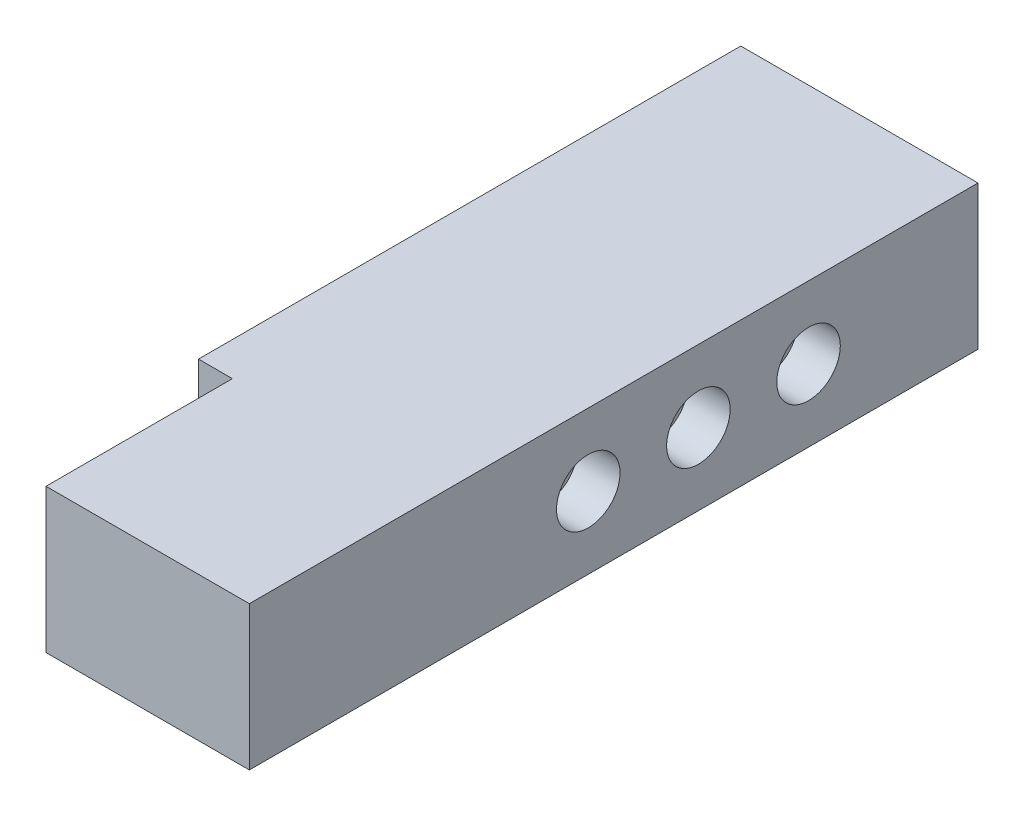
ISO-10303-21;
HEADER;
FILE_DESCRIPTION(('STEP AP214'),'2;1');
FILE_NAME('part.step','',(''),(''),'','','');
FILE_SCHEMA(('AUTOMOTIVE_DESIGN { 1 0 10303 214 1 1 1 1 }'));
ENDSEC;
DATA;
#1=APPLICATION_CONTEXT('core data for automotive mechanical design processes');
#2=APPLICATION_PROTOCOL_DEFINITION('international standard','automotive_design',2000,#1);
#3=PRODUCT_CONTEXT('',#1,'mechanical');
#4=PRODUCT('Part','Part','',(#3));
#5=PRODUCT_RELATED_PRODUCT_CATEGORY('part','',(#4));
#6=PRODUCT_DEFINITION_FORMATION('','',#4);
#7=PRODUCT_DEFINITION_CONTEXT('part definition',#1,'design');
#8=PRODUCT_DEFINITION('design','',#6,#7);
#9=PRODUCT_DEFINITION_SHAPE('','',#8);
#10=(LENGTH_UNIT() NAMED_UNIT(*) SI_UNIT(.MILLI.,.METRE.));
#11=(NAMED_UNIT(*) PLANE_ANGLE_UNIT() SI_UNIT($,.RADIAN.));
#12=(NAMED_UNIT(*) SI_UNIT($,.STERADIAN.) SOLID_ANGLE_UNIT());
#13=UNCERTAINTY_MEASURE_WITH_UNIT(LENGTH_MEASURE(1.E-05),#10,'distance_accuracy_value','');
#14=(GEOMETRIC_REPRESENTATION_CONTEXT(3) GLOBAL_UNCERTAINTY_ASSIGNED_CONTEXT((#13)) GLOBAL_UNIT_ASSIGNED_CONTEXT((#10,
#11,#12)) REPRESENTATION_CONTEXT('',''));
#15=CARTESIAN_POINT('',(0.,0.,0.));
#16=DIRECTION('',(0.,0.,1.));
#17=DIRECTION('',(1.,0.,0.));
#18=AXIS2_PLACEMENT_3D('',#15,#16,#17);
#19=CARTESIAN_POINT('',(0.,0.,81.28));
#20=DIRECTION('',(0.,0.,-1.));
#21=DIRECTION('',(-1.,0.,0.));
#22=AXIS2_PLACEMENT_3D('',#19,#20,#21);
#23=PLANE('',#22);
#24=DIRECTION('',(0.,-1.,0.));
#25=VECTOR('',#24,1.);
#26=CARTESIAN_POINT('',(5.07999999999999,21.59,81.28));
#27=LINE('',#26,#25);
#28=CARTESIAN_POINT('',(5.07999999999999,21.59,81.28));
#29=VERTEX_POINT('',#28);
#30=CARTESIAN_POINT('',(5.08,0.,81.28));
#31=VERTEX_POINT('',#30);
#32=EDGE_CURVE('E53',#29,#31,#27,.T.);
#33=ORIENTED_EDGE('',*,*,#32,.F.);
#34=DIRECTION('',(-1.,0.,0.));
#35=VECTOR('',#34,1.);
#36=CARTESIAN_POINT('',(0.,21.59,81.28));
#37=LINE('',#36,#35);
#38=CARTESIAN_POINT('',(0.,21.59,81.28));
#39=VERTEX_POINT('',#38);
#40=EDGE_CURVE('E58',#29,#39,#37,.T.);
#41=ORIENTED_EDGE('',*,*,#40,.T.);
#42=DIRECTION('',(0.,-1.,0.));
#43=VECTOR('',#42,1.);
#44=CARTESIAN_POINT('',(0.,0.,81.28));
#45=LINE('',#44,#43);
#46=CARTESIAN_POINT('',(0.,0.,81.28));
#47=VERTEX_POINT('',#46);
#48=EDGE_CURVE('E89',#39,#47,#45,.T.);
#49=ORIENTED_EDGE('',*,*,#48,.T.);
#50=DIRECTION('',(1.,0.,0.));
#51=VECTOR('',#50,1.);
#52=CARTESIAN_POINT('',(0.,0.,81.28));
#53=LINE('',#52,#51);
#54=EDGE_CURVE('E140',#47,#31,#53,.T.);
#55=ORIENTED_EDGE('',*,*,#54,.T.);
#56=EDGE_LOOP('',(#33,#41,#49,#55));
#57=FACE_BOUND('',#56,.T.);
#58=ADVANCED_FACE('F38',(#57),#23,.F.);
#59=CARTESIAN_POINT('',(0.,0.,81.28));
#60=DIRECTION('',(1.,0.,0.));
#61=DIRECTION('',(0.,0.,-1.));
#62=AXIS2_PLACEMENT_3D('',#59,#60,#61);
#63=PLANE('',#62);
#64=CARTESIAN_POINT('',(0.,10.795,33.655));
#65=DIRECTION('',(-1.,0.,0.));
#66=DIRECTION('',(0.,0.,1.));
#67=AXIS2_PLACEMENT_3D('',#64,#65,#66);
#68=CIRCLE('',#67,4.7625);
#69=CARTESIAN_POINT('',(0.,10.795,38.4175));
#70=VERTEX_POINT('',#69);
#71=EDGE_CURVE('E175',#70,#70,#68,.T.);
#72=ORIENTED_EDGE('',*,*,#71,.F.);
#73=EDGE_LOOP('',(#72));
#74=FACE_BOUND('',#73,.T.);
#75=CARTESIAN_POINT('',(0.,10.795,50.165));
#76=DIRECTION('',(-1.,0.,0.));
#77=DIRECTION('',(0.,0.,1.));
#78=AXIS2_PLACEMENT_3D('',#75,#76,#77);
#79=CIRCLE('',#78,4.7625);
#80=CARTESIAN_POINT('',(0.,10.795,54.9275));
#81=VERTEX_POINT('',#80);
#82=EDGE_CURVE('E169',#81,#81,#79,.T.);
#83=ORIENTED_EDGE('',*,*,#82,.F.);
#84=EDGE_LOOP('',(#83));
#85=FACE_BOUND('',#84,.T.);
#86=DIRECTION('',(0.,-1.,0.));
#87=VECTOR('',#86,1.);
#88=CARTESIAN_POINT('',(0.,0.,0.));
#89=LINE('',#88,#87);
#90=CARTESIAN_POINT('',(0.,21.59,0.));
#91=VERTEX_POINT('',#90);
#92=CARTESIAN_POINT('',(0.,0.,0.));
#93=VERTEX_POINT('',#92);
#94=EDGE_CURVE('E95',#91,#93,#89,.T.);
#95=ORIENTED_EDGE('',*,*,#94,.T.);
#96=DIRECTION('',(0.,0.,-1.));
#97=VECTOR('',#96,1.);
#98=CARTESIAN_POINT('',(0.,0.,81.28));
#99=LINE('',#98,#97);
#100=EDGE_CURVE('E11',#47,#93,#99,.T.);
#101=ORIENTED_EDGE('',*,*,#100,.F.);
#102=ORIENTED_EDGE('',*,*,#48,.F.);
#103=DIRECTION('',(0.,0.,-1.));
#104=VECTOR('',#103,1.);
#105=CARTESIAN_POINT('',(0.,21.59,81.28));
#106=LINE('',#105,#104);
#107=EDGE_CURVE('E81',#39,#91,#106,.T.);
#108=ORIENTED_EDGE('',*,*,#107,.T.);
#109=EDGE_LOOP('',(#95,#101,#102,#108));
#110=FACE_BOUND('',#109,.T.);
#111=ADVANCED_FACE('F40',(#74,#85,#110),#63,.F.);
#112=CARTESIAN_POINT('',(0.,0.,81.28));
#113=DIRECTION('',(0.,1.,0.));
#114=DIRECTION('',(0.,0.,1.));
#115=AXIS2_PLACEMENT_3D('',#112,#113,#114);
#116=PLANE('',#115);
#117=DIRECTION('',(1.,0.,0.));
#118=VECTOR('',#117,1.);
#119=CARTESIAN_POINT('',(0.,0.,0.));
#120=LINE('',#119,#118);
#121=CARTESIAN_POINT('',(35.56,0.,0.));
#122=VERTEX_POINT('',#121);
#123=EDGE_CURVE('E98',#93,#122,#120,.T.);
#124=ORIENTED_EDGE('',*,*,#123,.T.);
#125=DIRECTION('',(0.,0.,-1.));
#126=VECTOR('',#125,1.);
#127=CARTESIAN_POINT('',(35.56,0.,81.28));
#128=LINE('',#127,#126);
#129=CARTESIAN_POINT('',(35.56,0.,109.22));
#130=VERTEX_POINT('',#129);
#131=EDGE_CURVE('E46',#130,#122,#128,.T.);
#132=ORIENTED_EDGE('',*,*,#131,.F.);
#133=DIRECTION('',(1.,0.,0.));
#134=VECTOR('',#133,1.);
#135=CARTESIAN_POINT('',(35.56,0.,109.22));
#136=LINE('',#135,#134);
#137=CARTESIAN_POINT('',(5.08,0.,109.22));
#138=VERTEX_POINT('',#137);
#139=EDGE_CURVE('E122',#138,#130,#136,.T.);
#140=ORIENTED_EDGE('',*,*,#139,.F.);
#141=DIRECTION('',(0.,0.,-1.));
#142=VECTOR('',#141,1.);
#143=CARTESIAN_POINT('',(5.08,0.,109.22));
#144=LINE('',#143,#142);
#145=EDGE_CURVE('E103',#138,#31,#144,.T.);
#146=ORIENTED_EDGE('',*,*,#145,.T.);
#147=ORIENTED_EDGE('',*,*,#54,.F.);
#148=ORIENTED_EDGE('',*,*,#100,.T.);
#149=EDGE_LOOP('',(#124,#132,#140,#146,#147,#148));
#150=FACE_BOUND('',#149,.T.);
#151=ADVANCED_FACE('F119',(#150),#116,.F.);
#152=CARTESIAN_POINT('',(35.56,0.,81.28));
#153=DIRECTION('',(-1.,0.,0.));
#154=DIRECTION('',(0.,0.,1.));
#155=AXIS2_PLACEMENT_3D('',#152,#153,#154);
#156=PLANE('',#155);
#157=CARTESIAN_POINT('',(35.56,10.795,25.4));
#158=DIRECTION('',(1.,0.,0.));
#159=DIRECTION('',(0.,0.,-1.));
#160=AXIS2_PLACEMENT_3D('',#157,#158,#159);
#161=CIRCLE('',#160,4.7625);
#162=CARTESIAN_POINT('',(35.56,10.795,20.6375));
#163=VERTEX_POINT('',#162);
#164=EDGE_CURVE('E164',#163,#163,#161,.T.);
#165=ORIENTED_EDGE('',*,*,#164,.F.);
#166=EDGE_LOOP('',(#165));
#167=FACE_BOUND('',#166,.T.);
#168=CARTESIAN_POINT('',(35.56,10.795,41.91));
#169=DIRECTION('',(1.,0.,0.));
#170=DIRECTION('',(0.,0.,-1.));
#171=AXIS2_PLACEMENT_3D('',#168,#169,#170);
#172=CIRCLE('',#171,4.7625);
#173=CARTESIAN_POINT('',(35.56,10.795,37.1475));
#174=VERTEX_POINT('',#173);
#175=EDGE_CURVE('E158',#174,#174,#172,.T.);
#176=ORIENTED_EDGE('',*,*,#175,.F.);
#177=EDGE_LOOP('',(#176));
#178=FACE_BOUND('',#177,.T.);
#179=CARTESIAN_POINT('',(35.56,10.795,58.42));
#180=DIRECTION('',(1.,0.,0.));
#181=DIRECTION('',(0.,0.,-1.));
#182=AXIS2_PLACEMENT_3D('',#179,#180,#181);
#183=CIRCLE('',#182,4.7625);
#184=CARTESIAN_POINT('',(35.56,10.795,53.6575));
#185=VERTEX_POINT('',#184);
#186=EDGE_CURVE('E151',#185,#185,#183,.T.);
#187=ORIENTED_EDGE('',*,*,#186,.F.);
#188=EDGE_LOOP('',(#187));
#189=FACE_BOUND('',#188,.T.);
#190=DIRECTION('',(0.,1.,0.));
#191=VECTOR('',#190,1.);
#192=CARTESIAN_POINT('',(35.56,0.,0.));
#193=LINE('',#192,#191);
#194=CARTESIAN_POINT('',(35.56,21.59,0.));
#195=VERTEX_POINT('',#194);
#196=EDGE_CURVE('E90',#122,#195,#193,.T.);
#197=ORIENTED_EDGE('',*,*,#196,.T.);
#198=DIRECTION('',(0.,0.,-1.));
#199=VECTOR('',#198,1.);
#200=CARTESIAN_POINT('',(35.56,21.59,81.28));
#201=LINE('',#200,#199);
#202=CARTESIAN_POINT('',(35.56,21.59,109.22));
#203=VERTEX_POINT('',#202);
#204=EDGE_CURVE('E85',#203,#195,#201,.T.);
#205=ORIENTED_EDGE('',*,*,#204,.F.);
#206=DIRECTION('',(0.,1.,0.));
#207=VECTOR('',#206,1.);
#208=CARTESIAN_POINT('',(35.56,21.59,109.22));
#209=LINE('',#208,#207);
#210=EDGE_CURVE('E115',#130,#203,#209,.T.);
#211=ORIENTED_EDGE('',*,*,#210,.F.);
#212=ORIENTED_EDGE('',*,*,#131,.T.);
#213=EDGE_LOOP('',(#197,#205,#211,#212));
#214=FACE_BOUND('',#213,.T.);
#215=ADVANCED_FACE('F113',(#167,#178,#189,#214),#156,.F.);
#216=CARTESIAN_POINT('',(0.,21.59,81.28));
#217=DIRECTION('',(0.,-1.,0.));
#218=DIRECTION('',(0.,0.,-1.));
#219=AXIS2_PLACEMENT_3D('',#216,#217,#218);
#220=PLANE('',#219);
#221=DIRECTION('',(-1.,0.,0.));
#222=VECTOR('',#221,1.);
#223=CARTESIAN_POINT('',(0.,21.59,0.));
#224=LINE('',#223,#222);
#225=EDGE_CURVE('E78',#195,#91,#224,.T.);
#226=ORIENTED_EDGE('',*,*,#225,.T.);
#227=ORIENTED_EDGE('',*,*,#107,.F.);
#228=ORIENTED_EDGE('',*,*,#40,.F.);
#229=DIRECTION('',(0.,0.,-1.));
#230=VECTOR('',#229,1.);
#231=CARTESIAN_POINT('',(5.07999999999999,21.59,109.22));
#232=LINE('',#231,#230);
#233=CARTESIAN_POINT('',(5.07999999999999,21.59,109.22));
#234=VERTEX_POINT('',#233);
#235=EDGE_CURVE('E99',#234,#29,#232,.T.);
#236=ORIENTED_EDGE('',*,*,#235,.F.);
#237=DIRECTION('',(-1.,0.,0.));
#238=VECTOR('',#237,1.);
#239=CARTESIAN_POINT('',(35.56,21.59,109.22));
#240=LINE('',#239,#238);
#241=EDGE_CURVE('E134',#203,#234,#240,.T.);
#242=ORIENTED_EDGE('',*,*,#241,.F.);
#243=ORIENTED_EDGE('',*,*,#204,.T.);
#244=EDGE_LOOP('',(#226,#227,#228,#236,#242,#243));
#245=FACE_BOUND('',#244,.T.);
#246=ADVANCED_FACE('F80',(#245),#220,.F.);
#247=CARTESIAN_POINT('',(0.,0.,0.));
#248=DIRECTION('',(0.,0.,-1.));
#249=DIRECTION('',(-1.,0.,0.));
#250=AXIS2_PLACEMENT_3D('',#247,#248,#249);
#251=PLANE('',#250);
#252=ORIENTED_EDGE('',*,*,#94,.F.);
#253=ORIENTED_EDGE('',*,*,#225,.F.);
#254=ORIENTED_EDGE('',*,*,#196,.F.);
#255=ORIENTED_EDGE('',*,*,#123,.F.);
#256=EDGE_LOOP('',(#252,#253,#254,#255));
#257=FACE_BOUND('',#256,.T.);
#258=ADVANCED_FACE('F97',(#257),#251,.T.);
#259=CARTESIAN_POINT('',(5.07999999999999,21.59,109.22));
#260=DIRECTION('',(1.,0.,0.));
#261=DIRECTION('',(0.,1.,0.));
#262=AXIS2_PLACEMENT_3D('',#259,#260,#261);
#263=PLANE('',#262);
#264=ORIENTED_EDGE('',*,*,#32,.T.);
#265=ORIENTED_EDGE('',*,*,#145,.F.);
#266=DIRECTION('',(0.,-1.,0.));
#267=VECTOR('',#266,1.);
#268=CARTESIAN_POINT('',(5.07999999999999,21.59,109.22));
#269=LINE('',#268,#267);
#270=EDGE_CURVE('E130',#234,#138,#269,.T.);
#271=ORIENTED_EDGE('',*,*,#270,.F.);
#272=ORIENTED_EDGE('',*,*,#235,.T.);
#273=EDGE_LOOP('',(#264,#265,#271,#272));
#274=FACE_BOUND('',#273,.T.);
#275=ADVANCED_FACE('F143',(#274),#263,.F.);
#276=CARTESIAN_POINT('',(0.,0.,109.22));
#277=DIRECTION('',(0.,0.,-1.));
#278=DIRECTION('',(-1.,0.,0.));
#279=AXIS2_PLACEMENT_3D('',#276,#277,#278);
#280=PLANE('',#279);
#281=ORIENTED_EDGE('',*,*,#210,.T.);
#282=ORIENTED_EDGE('',*,*,#241,.T.);
#283=ORIENTED_EDGE('',*,*,#270,.T.);
#284=ORIENTED_EDGE('',*,*,#139,.T.);
#285=EDGE_LOOP('',(#281,#282,#283,#284));
#286=FACE_BOUND('',#285,.T.);
#287=ADVANCED_FACE('F126',(#286),#280,.F.);
#288=CARTESIAN_POINT('',(29.21,10.795,58.42));
#289=DIRECTION('',(1.,0.,0.));
#290=DIRECTION('',(0.,0.,-1.));
#291=AXIS2_PLACEMENT_3D('',#288,#289,#290);
#292=CYLINDRICAL_SURFACE('',#291,4.7625);
#293=CARTESIAN_POINT('',(29.21,10.795,58.42));
#294=DIRECTION('',(1.,0.,0.));
#295=DIRECTION('',(0.,0.,-1.));
#296=AXIS2_PLACEMENT_3D('',#293,#294,#295);
#297=CIRCLE('',#296,4.7625);
#298=CARTESIAN_POINT('',(29.21,10.795,53.6575));
#299=VERTEX_POINT('',#298);
#300=EDGE_CURVE('E154',#299,#299,#297,.T.);
#301=ORIENTED_EDGE('',*,*,#300,.F.);
#302=EDGE_LOOP('',(#301));
#303=FACE_BOUND('',#302,.T.);
#304=ORIENTED_EDGE('',*,*,#186,.T.);
#305=EDGE_LOOP('',(#304));
#306=FACE_BOUND('',#305,.T.);
#307=ADVANCED_FACE('F252',(#303,#306),#292,.F.);
#308=CARTESIAN_POINT('',(29.21,10.795,58.42));
#309=DIRECTION('',(1.,0.,0.));
#310=DIRECTION('',(0.,0.,-1.));
#311=AXIS2_PLACEMENT_3D('',#308,#309,#310);
#312=PLANE('',#311);
#313=ORIENTED_EDGE('',*,*,#300,.T.);
#314=EDGE_LOOP('',(#313));
#315=FACE_BOUND('',#314,.T.);
#316=ADVANCED_FACE('F257',(#315),#312,.T.);
#317=CARTESIAN_POINT('',(29.21,10.795,41.91));
#318=DIRECTION('',(1.,0.,0.));
#319=DIRECTION('',(0.,0.,-1.));
#320=AXIS2_PLACEMENT_3D('',#317,#318,#319);
#321=CYLINDRICAL_SURFACE('',#320,4.7625);
#322=CARTESIAN_POINT('',(29.21,10.795,41.91));
#323=DIRECTION('',(1.,0.,0.));
#324=DIRECTION('',(0.,0.,-1.));
#325=AXIS2_PLACEMENT_3D('',#322,#323,#324);
#326=CIRCLE('',#325,4.7625);
#327=CARTESIAN_POINT('',(29.21,10.795,37.1475));
#328=VERTEX_POINT('',#327);
#329=EDGE_CURVE('E161',#328,#328,#326,.T.);
#330=ORIENTED_EDGE('',*,*,#329,.F.);
#331=EDGE_LOOP('',(#330));
#332=FACE_BOUND('',#331,.T.);
#333=ORIENTED_EDGE('',*,*,#175,.T.);
#334=EDGE_LOOP('',(#333));
#335=FACE_BOUND('',#334,.T.);
#336=ADVANCED_FACE('F265',(#332,#335),#321,.F.);
#337=CARTESIAN_POINT('',(29.21,10.795,41.91));
#338=DIRECTION('',(1.,0.,0.));
#339=DIRECTION('',(0.,0.,-1.));
#340=AXIS2_PLACEMENT_3D('',#337,#338,#339);
#341=PLANE('',#340);
#342=ORIENTED_EDGE('',*,*,#329,.T.);
#343=EDGE_LOOP('',(#342));
#344=FACE_BOUND('',#343,.T.);
#345=ADVANCED_FACE('F273',(#344),#341,.T.);
#346=CARTESIAN_POINT('',(29.21,10.795,25.4));
#347=DIRECTION('',(1.,0.,0.));
#348=DIRECTION('',(0.,0.,-1.));
#349=AXIS2_PLACEMENT_3D('',#346,#347,#348);
#350=CYLINDRICAL_SURFACE('',#349,4.7625);
#351=CARTESIAN_POINT('',(29.21,10.795,25.4));
#352=DIRECTION('',(1.,0.,0.));
#353=DIRECTION('',(0.,0.,-1.));
#354=AXIS2_PLACEMENT_3D('',#351,#352,#353);
#355=CIRCLE('',#354,4.7625);
#356=CARTESIAN_POINT('',(29.21,10.795,20.6375));
#357=VERTEX_POINT('',#356);
#358=EDGE_CURVE('E138',#357,#357,#355,.T.);
#359=ORIENTED_EDGE('',*,*,#358,.F.);
#360=EDGE_LOOP('',(#359));
#361=FACE_BOUND('',#360,.T.);
#362=ORIENTED_EDGE('',*,*,#164,.T.);
#363=EDGE_LOOP('',(#362));
#364=FACE_BOUND('',#363,.T.);
#365=ADVANCED_FACE('F205',(#361,#364),#350,.F.);
#366=CARTESIAN_POINT('',(29.21,10.795,25.4));
#367=DIRECTION('',(1.,0.,0.));
#368=DIRECTION('',(0.,0.,-1.));
#369=AXIS2_PLACEMENT_3D('',#366,#367,#368);
#370=PLANE('',#369);
#371=ORIENTED_EDGE('',*,*,#358,.T.);
#372=EDGE_LOOP('',(#371));
#373=FACE_BOUND('',#372,.T.);
#374=ADVANCED_FACE('F196',(#373),#370,.T.);
#375=CARTESIAN_POINT('',(6.35,10.795,50.165));
#376=DIRECTION('',(-1.,0.,0.));
#377=DIRECTION('',(0.,0.,1.));
#378=AXIS2_PLACEMENT_3D('',#375,#376,#377);
#379=CYLINDRICAL_SURFACE('',#378,4.7625);
#380=CARTESIAN_POINT('',(6.35,10.795,50.165));
#381=DIRECTION('',(-1.,0.,0.));
#382=DIRECTION('',(0.,0.,1.));
#383=AXIS2_PLACEMENT_3D('',#380,#381,#382);
#384=CIRCLE('',#383,4.7625);
#385=CARTESIAN_POINT('',(6.35,10.795,54.9275));
#386=VERTEX_POINT('',#385);
#387=EDGE_CURVE('E172',#386,#386,#384,.T.);
#388=ORIENTED_EDGE('',*,*,#387,.F.);
#389=EDGE_LOOP('',(#388));
#390=FACE_BOUND('',#389,.T.);
#391=ORIENTED_EDGE('',*,*,#82,.T.);
#392=EDGE_LOOP('',(#391));
#393=FACE_BOUND('',#392,.T.);
#394=ADVANCED_FACE('F194',(#390,#393),#379,.F.);
#395=CARTESIAN_POINT('',(6.35,10.795,50.165));
#396=DIRECTION('',(-1.,0.,0.));
#397=DIRECTION('',(0.,0.,1.));
#398=AXIS2_PLACEMENT_3D('',#395,#396,#397);
#399=PLANE('',#398);
#400=ORIENTED_EDGE('',*,*,#387,.T.);
#401=EDGE_LOOP('',(#400));
#402=FACE_BOUND('',#401,.T.);
#403=ADVANCED_FACE('F186',(#402),#399,.T.);
#404=CARTESIAN_POINT('',(6.35,10.795,33.655));
#405=DIRECTION('',(-1.,0.,0.));
#406=DIRECTION('',(0.,0.,1.));
#407=AXIS2_PLACEMENT_3D('',#404,#405,#406);
#408=CYLINDRICAL_SURFACE('',#407,4.7625);
#409=CARTESIAN_POINT('',(6.35,10.795,33.655));
#410=DIRECTION('',(-1.,0.,0.));
#411=DIRECTION('',(0.,0.,1.));
#412=AXIS2_PLACEMENT_3D('',#409,#410,#411);
#413=CIRCLE('',#412,4.7625);
#414=CARTESIAN_POINT('',(6.35,10.795,38.4175));
#415=VERTEX_POINT('',#414);
#416=EDGE_CURVE('E155',#415,#415,#413,.T.);
#417=ORIENTED_EDGE('',*,*,#416,.F.);
#418=EDGE_LOOP('',(#417));
#419=FACE_BOUND('',#418,.T.);
#420=ORIENTED_EDGE('',*,*,#71,.T.);
#421=EDGE_LOOP('',(#420));
#422=FACE_BOUND('',#421,.T.);
#423=ADVANCED_FACE('F183',(#419,#422),#408,.F.);
#424=CARTESIAN_POINT('',(6.35,10.795,33.655));
#425=DIRECTION('',(-1.,0.,0.));
#426=DIRECTION('',(0.,0.,1.));
#427=AXIS2_PLACEMENT_3D('',#424,#425,#426);
#428=PLANE('',#427);
#429=ORIENTED_EDGE('',*,*,#416,.T.);
#430=EDGE_LOOP('',(#429));
#431=FACE_BOUND('',#430,.T.);
#432=ADVANCED_FACE('F181',(#431),#428,.T.);
#433=CLOSED_SHELL('',(#58,#111,#151,#215,#246,#258,#275,#287,#307,#316,#336,#345,#365,#374,#394,
#403,#423,#432));
#434=MANIFOLD_SOLID_BREP('B2',#433);
#435=ADVANCED_BREP_SHAPE_REPRESENTATION('',(#18,#434),#14);
#436=SHAPE_DEFINITION_REPRESENTATION(#9,#435);
ENDSEC;
END-ISO-10303-21;
